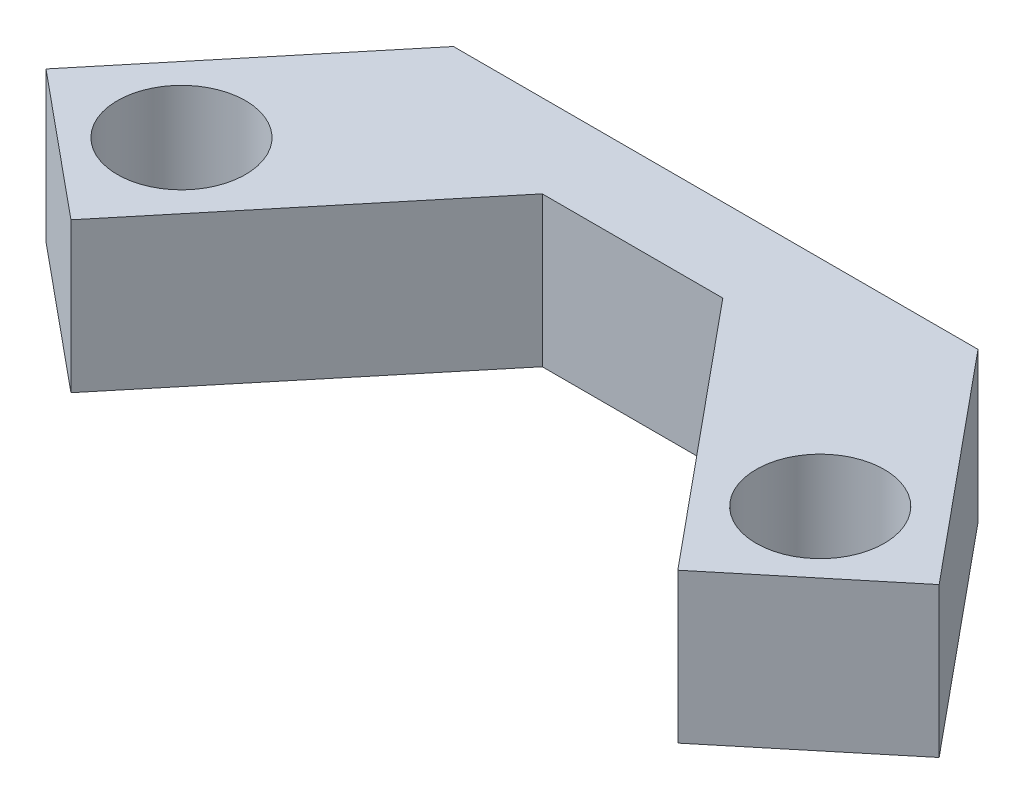
ISO-10303-21;
HEADER;
FILE_DESCRIPTION(('STEP AP214'),'2;1');
FILE_NAME('part.step','',(''),(''),'','','');
FILE_SCHEMA(('AUTOMOTIVE_DESIGN { 1 0 10303 214 1 1 1 1 }'));
ENDSEC;
DATA;
#1=APPLICATION_CONTEXT('core data for automotive mechanical design processes');
#2=APPLICATION_PROTOCOL_DEFINITION('international standard','automotive_design',2000,#1);
#3=PRODUCT_CONTEXT('',#1,'mechanical');
#4=PRODUCT('Part','Part','',(#3));
#5=PRODUCT_RELATED_PRODUCT_CATEGORY('part','',(#4));
#6=PRODUCT_DEFINITION_FORMATION('','',#4);
#7=PRODUCT_DEFINITION_CONTEXT('part definition',#1,'design');
#8=PRODUCT_DEFINITION('design','',#6,#7);
#9=PRODUCT_DEFINITION_SHAPE('','',#8);
#10=(LENGTH_UNIT() NAMED_UNIT(*) SI_UNIT(.MILLI.,.METRE.));
#11=(NAMED_UNIT(*) PLANE_ANGLE_UNIT() SI_UNIT($,.RADIAN.));
#12=(NAMED_UNIT(*) SI_UNIT($,.STERADIAN.) SOLID_ANGLE_UNIT());
#13=UNCERTAINTY_MEASURE_WITH_UNIT(LENGTH_MEASURE(1.E-05),#10,'distance_accuracy_value','');
#14=(GEOMETRIC_REPRESENTATION_CONTEXT(3) GLOBAL_UNCERTAINTY_ASSIGNED_CONTEXT((#13)) GLOBAL_UNIT_ASSIGNED_CONTEXT((#10,
#11,#12)) REPRESENTATION_CONTEXT('',''));
#15=CARTESIAN_POINT('',(0.,0.,0.));
#16=DIRECTION('',(0.,0.,1.));
#17=DIRECTION('',(1.,0.,0.));
#18=AXIS2_PLACEMENT_3D('',#15,#16,#17);
#19=CARTESIAN_POINT('',(0.,18.,0.));
#20=DIRECTION('',(0.,-1.,0.));
#21=DIRECTION('',(0.,0.,-1.));
#22=AXIS2_PLACEMENT_3D('',#19,#20,#21);
#23=PLANE('',#22);
#24=DIRECTION('',(-0.636770140264585,0.,-0.771053687149877));
#25=VECTOR('',#24,1.);
#26=CARTESIAN_POINT('',(29.8117385024772,18.,-15.2291264643002));
#27=LINE('',#26,#25);
#28=CARTESIAN_POINT('',(51.9636815392231,18.,11.5942691002592));
#29=VERTEX_POINT('',#28);
#30=CARTESIAN_POINT('',(29.8117385024772,18.,-15.2291264643002));
#31=VERTEX_POINT('',#30);
#32=EDGE_CURVE('E166',#29,#31,#27,.T.);
#33=ORIENTED_EDGE('',*,*,#32,.T.);
#34=DIRECTION('',(-1.,0.,0.));
#35=VECTOR('',#34,1.);
#36=CARTESIAN_POINT('',(-33.2382614975228,18.,-15.2291264643002));
#37=LINE('',#36,#35);
#38=CARTESIAN_POINT('',(-33.2382614975228,18.,-15.2291264643002));
#39=VERTEX_POINT('',#38);
#40=EDGE_CURVE('E102',#31,#39,#37,.T.);
#41=ORIENTED_EDGE('',*,*,#40,.T.);
#42=DIRECTION('',(-0.636770140264585,0.,0.771053687149877));
#43=VECTOR('',#42,1.);
#44=CARTESIAN_POINT('',(-33.2382614975228,18.,-15.2291264643002));
#45=LINE('',#44,#43);
#46=CARTESIAN_POINT('',(-55.3902045342687,18.,11.5942691002592));
#47=VERTEX_POINT('',#46);
#48=EDGE_CURVE('E187',#39,#47,#45,.T.);
#49=ORIENTED_EDGE('',*,*,#48,.T.);
#50=DIRECTION('',(0.771053687149877,0.,0.636770140264585));
#51=VECTOR('',#50,1.);
#52=CARTESIAN_POINT('',(-55.3902045342687,18.,11.5942691002592));
#53=LINE('',#52,#51);
#54=CARTESIAN_POINT('',(-38.1884914063332,18.,25.8002024403296));
#55=VERTEX_POINT('',#54);
#56=EDGE_CURVE('E201',#47,#55,#53,.T.);
#57=ORIENTED_EDGE('',*,*,#56,.T.);
#58=DIRECTION('',(0.636770140264584,0.,-0.771053687149878));
#59=VECTOR('',#58,1.);
#60=CARTESIAN_POINT('',(-38.1884914063332,18.,25.8002024403296));
#61=LINE('',#60,#59);
#62=CARTESIAN_POINT('',(-12.5631031250677,18.,-5.22912646430025));
#63=VERTEX_POINT('',#62);
#64=EDGE_CURVE('E121',#55,#63,#61,.T.);
#65=ORIENTED_EDGE('',*,*,#64,.T.);
#66=DIRECTION('',(1.,0.,0.));
#67=VECTOR('',#66,1.);
#68=CARTESIAN_POINT('',(9.13658013002208,18.,-5.22912646430025));
#69=LINE('',#68,#67);
#70=CARTESIAN_POINT('',(9.13658013002208,18.,-5.22912646430025));
#71=VERTEX_POINT('',#70);
#72=EDGE_CURVE('E115',#63,#71,#69,.T.);
#73=ORIENTED_EDGE('',*,*,#72,.T.);
#74=DIRECTION('',(0.636770140264585,0.,0.771053687149877));
#75=VECTOR('',#74,1.);
#76=CARTESIAN_POINT('',(34.7619684112876,18.,25.8002024403295));
#77=LINE('',#76,#75);
#78=CARTESIAN_POINT('',(34.7619684112876,18.,25.8002024403295));
#79=VERTEX_POINT('',#78);
#80=EDGE_CURVE('E119',#71,#79,#77,.T.);
#81=ORIENTED_EDGE('',*,*,#80,.T.);
#82=DIRECTION('',(0.771053687149877,0.,-0.636770140264586));
#83=VECTOR('',#82,1.);
#84=CARTESIAN_POINT('',(51.9636815392231,18.,11.5942691002592));
#85=LINE('',#84,#83);
#86=EDGE_CURVE('E59',#79,#29,#85,.T.);
#87=ORIENTED_EDGE('',*,*,#86,.T.);
#88=EDGE_LOOP('',(#33,#41,#49,#57,#65,#73,#81,#87));
#89=FACE_BOUND('',#88,.T.);
#90=CARTESIAN_POINT('',(36.6767385024772,18.,10.6011720552206));
#91=DIRECTION('',(0.,1.,0.));
#92=DIRECTION('',(0.,0.,1.));
#93=AXIS2_PLACEMENT_3D('',#90,#91,#92);
#94=CIRCLE('',#93,7.7);
#95=CARTESIAN_POINT('',(36.6767385024772,18.,18.3011720552206));
#96=VERTEX_POINT('',#95);
#97=EDGE_CURVE('E148',#96,#96,#94,.T.);
#98=ORIENTED_EDGE('',*,*,#97,.F.);
#99=EDGE_LOOP('',(#98));
#100=FACE_BOUND('',#99,.T.);
#101=CARTESIAN_POINT('',(-40.1032614975228,18.,10.6011720552206));
#102=DIRECTION('',(0.,1.,0.));
#103=DIRECTION('',(0.,0.,-1.));
#104=AXIS2_PLACEMENT_3D('',#101,#102,#103);
#105=CIRCLE('',#104,7.7);
#106=CARTESIAN_POINT('',(-40.1032614975228,18.,2.90117205522064));
#107=VERTEX_POINT('',#106);
#108=EDGE_CURVE('E215',#107,#107,#105,.T.);
#109=ORIENTED_EDGE('',*,*,#108,.F.);
#110=EDGE_LOOP('',(#109));
#111=FACE_BOUND('',#110,.T.);
#112=ADVANCED_FACE('F41',(#89,#100,#111),#23,.F.);
#113=CARTESIAN_POINT('',(0.,0.,0.));
#114=DIRECTION('',(0.,-1.,0.));
#115=DIRECTION('',(0.,0.,-1.));
#116=AXIS2_PLACEMENT_3D('',#113,#114,#115);
#117=PLANE('',#116);
#118=CARTESIAN_POINT('',(36.6767385024772,0.,10.6011720552206));
#119=DIRECTION('',(0.,1.,0.));
#120=DIRECTION('',(0.,0.,1.));
#121=AXIS2_PLACEMENT_3D('',#118,#119,#120);
#122=CIRCLE('',#121,7.7);
#123=CARTESIAN_POINT('',(36.6767385024772,0.,18.3011720552206));
#124=VERTEX_POINT('',#123);
#125=EDGE_CURVE('E211',#124,#124,#122,.T.);
#126=ORIENTED_EDGE('',*,*,#125,.T.);
#127=EDGE_LOOP('',(#126));
#128=FACE_BOUND('',#127,.T.);
#129=DIRECTION('',(-0.636770140264585,0.,-0.771053687149877));
#130=VECTOR('',#129,1.);
#131=CARTESIAN_POINT('',(29.8117385024772,0.,-15.2291264643002));
#132=LINE('',#131,#130);
#133=CARTESIAN_POINT('',(51.9636815392231,0.,11.5942691002592));
#134=VERTEX_POINT('',#133);
#135=CARTESIAN_POINT('',(29.8117385024772,0.,-15.2291264643002));
#136=VERTEX_POINT('',#135);
#137=EDGE_CURVE('E143',#134,#136,#132,.T.);
#138=ORIENTED_EDGE('',*,*,#137,.F.);
#139=DIRECTION('',(0.771053687149877,0.,-0.636770140264586));
#140=VECTOR('',#139,1.);
#141=CARTESIAN_POINT('',(51.9636815392231,0.,11.5942691002592));
#142=LINE('',#141,#140);
#143=CARTESIAN_POINT('',(34.7619684112876,0.,25.8002024403295));
#144=VERTEX_POINT('',#143);
#145=EDGE_CURVE('E94',#144,#134,#142,.T.);
#146=ORIENTED_EDGE('',*,*,#145,.F.);
#147=DIRECTION('',(0.636770140264585,0.,0.771053687149877));
#148=VECTOR('',#147,1.);
#149=CARTESIAN_POINT('',(34.7619684112876,0.,25.8002024403295));
#150=LINE('',#149,#148);
#151=CARTESIAN_POINT('',(9.13658013002208,0.,-5.22912646430025));
#152=VERTEX_POINT('',#151);
#153=EDGE_CURVE('E88',#152,#144,#150,.T.);
#154=ORIENTED_EDGE('',*,*,#153,.F.);
#155=DIRECTION('',(1.,0.,0.));
#156=VECTOR('',#155,1.);
#157=CARTESIAN_POINT('',(9.13658013002208,0.,-5.22912646430025));
#158=LINE('',#157,#156);
#159=CARTESIAN_POINT('',(-12.5631031250677,0.,-5.22912646430025));
#160=VERTEX_POINT('',#159);
#161=EDGE_CURVE('E130',#160,#152,#158,.T.);
#162=ORIENTED_EDGE('',*,*,#161,.F.);
#163=DIRECTION('',(0.636770140264584,0.,-0.771053687149878));
#164=VECTOR('',#163,1.);
#165=CARTESIAN_POINT('',(-38.1884914063332,0.,25.8002024403296));
#166=LINE('',#165,#164);
#167=CARTESIAN_POINT('',(-38.1884914063332,0.,25.8002024403296));
#168=VERTEX_POINT('',#167);
#169=EDGE_CURVE('E157',#168,#160,#166,.T.);
#170=ORIENTED_EDGE('',*,*,#169,.F.);
#171=DIRECTION('',(0.771053687149877,0.,0.636770140264585));
#172=VECTOR('',#171,1.);
#173=CARTESIAN_POINT('',(-55.3902045342687,0.,11.5942691002592));
#174=LINE('',#173,#172);
#175=CARTESIAN_POINT('',(-55.3902045342687,0.,11.5942691002592));
#176=VERTEX_POINT('',#175);
#177=EDGE_CURVE('E154',#176,#168,#174,.T.);
#178=ORIENTED_EDGE('',*,*,#177,.F.);
#179=DIRECTION('',(-0.636770140264585,0.,0.771053687149877));
#180=VECTOR('',#179,1.);
#181=CARTESIAN_POINT('',(-33.2382614975228,0.,-15.2291264643002));
#182=LINE('',#181,#180);
#183=CARTESIAN_POINT('',(-33.2382614975228,0.,-15.2291264643002));
#184=VERTEX_POINT('',#183);
#185=EDGE_CURVE('E151',#184,#176,#182,.T.);
#186=ORIENTED_EDGE('',*,*,#185,.F.);
#187=DIRECTION('',(-1.,0.,0.));
#188=VECTOR('',#187,1.);
#189=CARTESIAN_POINT('',(-33.2382614975228,0.,-15.2291264643002));
#190=LINE('',#189,#188);
#191=EDGE_CURVE('E147',#136,#184,#190,.T.);
#192=ORIENTED_EDGE('',*,*,#191,.F.);
#193=EDGE_LOOP('',(#138,#146,#154,#162,#170,#178,#186,#192));
#194=FACE_BOUND('',#193,.T.);
#195=CARTESIAN_POINT('',(-40.1032614975228,0.,10.6011720552206));
#196=DIRECTION('',(0.,1.,0.));
#197=DIRECTION('',(0.,0.,-1.));
#198=AXIS2_PLACEMENT_3D('',#195,#196,#197);
#199=CIRCLE('',#198,7.7);
#200=CARTESIAN_POINT('',(-40.1032614975228,0.,2.90117205522064));
#201=VERTEX_POINT('',#200);
#202=EDGE_CURVE('E219',#201,#201,#199,.T.);
#203=ORIENTED_EDGE('',*,*,#202,.T.);
#204=EDGE_LOOP('',(#203));
#205=FACE_BOUND('',#204,.T.);
#206=ADVANCED_FACE('F191',(#128,#194,#205),#117,.T.);
#207=CARTESIAN_POINT('',(29.8117385024772,18.,-15.2291264643002));
#208=DIRECTION('',(-0.771053687149877,0.,0.636770140264585));
#209=DIRECTION('',(0.636770140264586,0.,0.771053687149877));
#210=AXIS2_PLACEMENT_3D('',#207,#208,#209);
#211=PLANE('',#210);
#212=ORIENTED_EDGE('',*,*,#137,.T.);
#213=DIRECTION('',(0.,-1.,0.));
#214=VECTOR('',#213,1.);
#215=CARTESIAN_POINT('',(29.8117385024772,18.,-15.2291264643002));
#216=LINE('',#215,#214);
#217=EDGE_CURVE('E11',#31,#136,#216,.T.);
#218=ORIENTED_EDGE('',*,*,#217,.F.);
#219=ORIENTED_EDGE('',*,*,#32,.F.);
#220=DIRECTION('',(0.,-1.,0.));
#221=VECTOR('',#220,1.);
#222=CARTESIAN_POINT('',(51.9636815392231,18.,11.5942691002592));
#223=LINE('',#222,#221);
#224=EDGE_CURVE('E139',#29,#134,#223,.T.);
#225=ORIENTED_EDGE('',*,*,#224,.T.);
#226=EDGE_LOOP('',(#212,#218,#219,#225));
#227=FACE_BOUND('',#226,.T.);
#228=ADVANCED_FACE('F43',(#227),#211,.F.);
#229=CARTESIAN_POINT('',(-33.2382614975228,18.,-15.2291264643002));
#230=DIRECTION('',(0.,0.,1.));
#231=DIRECTION('',(1.,0.,0.));
#232=AXIS2_PLACEMENT_3D('',#229,#230,#231);
#233=PLANE('',#232);
#234=ORIENTED_EDGE('',*,*,#191,.T.);
#235=DIRECTION('',(0.,-1.,0.));
#236=VECTOR('',#235,1.);
#237=CARTESIAN_POINT('',(-33.2382614975228,18.,-15.2291264643002));
#238=LINE('',#237,#236);
#239=EDGE_CURVE('E51',#39,#184,#238,.T.);
#240=ORIENTED_EDGE('',*,*,#239,.F.);
#241=ORIENTED_EDGE('',*,*,#40,.F.);
#242=ORIENTED_EDGE('',*,*,#217,.T.);
#243=EDGE_LOOP('',(#234,#240,#241,#242));
#244=FACE_BOUND('',#243,.T.);
#245=ADVANCED_FACE('F253',(#244),#233,.F.);
#246=CARTESIAN_POINT('',(-33.2382614975228,18.,-15.2291264643002));
#247=DIRECTION('',(0.771053687149877,0.,0.636770140264585));
#248=DIRECTION('',(0.636770140264585,0.,-0.771053687149877));
#249=AXIS2_PLACEMENT_3D('',#246,#247,#248);
#250=PLANE('',#249);
#251=ORIENTED_EDGE('',*,*,#185,.T.);
#252=DIRECTION('',(0.,-1.,0.));
#253=VECTOR('',#252,1.);
#254=CARTESIAN_POINT('',(-55.3902045342687,18.,11.5942691002592));
#255=LINE('',#254,#253);
#256=EDGE_CURVE('E177',#47,#176,#255,.T.);
#257=ORIENTED_EDGE('',*,*,#256,.F.);
#258=ORIENTED_EDGE('',*,*,#48,.F.);
#259=ORIENTED_EDGE('',*,*,#239,.T.);
#260=EDGE_LOOP('',(#251,#257,#258,#259));
#261=FACE_BOUND('',#260,.T.);
#262=ADVANCED_FACE('F185',(#261),#250,.F.);
#263=CARTESIAN_POINT('',(-55.3902045342687,18.,11.5942691002592));
#264=DIRECTION('',(0.636770140264585,0.,-0.771053687149877));
#265=DIRECTION('',(-0.771053687149877,0.,-0.636770140264585));
#266=AXIS2_PLACEMENT_3D('',#263,#264,#265);
#267=PLANE('',#266);
#268=ORIENTED_EDGE('',*,*,#177,.T.);
#269=DIRECTION('',(0.,-1.,0.));
#270=VECTOR('',#269,1.);
#271=CARTESIAN_POINT('',(-38.1884914063332,18.,25.8002024403296));
#272=LINE('',#271,#270);
#273=EDGE_CURVE('E173',#55,#168,#272,.T.);
#274=ORIENTED_EDGE('',*,*,#273,.F.);
#275=ORIENTED_EDGE('',*,*,#56,.F.);
#276=ORIENTED_EDGE('',*,*,#256,.T.);
#277=EDGE_LOOP('',(#268,#274,#275,#276));
#278=FACE_BOUND('',#277,.T.);
#279=ADVANCED_FACE('F196',(#278),#267,.F.);
#280=CARTESIAN_POINT('',(-38.1884914063332,18.,25.8002024403296));
#281=DIRECTION('',(-0.771053687149878,0.,-0.636770140264584));
#282=DIRECTION('',(-0.636770140264584,0.,0.771053687149878));
#283=AXIS2_PLACEMENT_3D('',#280,#281,#282);
#284=PLANE('',#283);
#285=ORIENTED_EDGE('',*,*,#169,.T.);
#286=DIRECTION('',(0.,-1.,0.));
#287=VECTOR('',#286,1.);
#288=CARTESIAN_POINT('',(-12.5631031250677,18.,-5.22912646430025));
#289=LINE('',#288,#287);
#290=EDGE_CURVE('E132',#63,#160,#289,.T.);
#291=ORIENTED_EDGE('',*,*,#290,.F.);
#292=ORIENTED_EDGE('',*,*,#64,.F.);
#293=ORIENTED_EDGE('',*,*,#273,.T.);
#294=EDGE_LOOP('',(#285,#291,#292,#293));
#295=FACE_BOUND('',#294,.T.);
#296=ADVANCED_FACE('F199',(#295),#284,.F.);
#297=CARTESIAN_POINT('',(9.13658013002208,18.,-5.22912646430025));
#298=DIRECTION('',(0.,0.,-1.));
#299=DIRECTION('',(-1.,0.,0.));
#300=AXIS2_PLACEMENT_3D('',#297,#298,#299);
#301=PLANE('',#300);
#302=ORIENTED_EDGE('',*,*,#161,.T.);
#303=DIRECTION('',(0.,-1.,0.));
#304=VECTOR('',#303,1.);
#305=CARTESIAN_POINT('',(9.13658013002208,18.,-5.22912646430025));
#306=LINE('',#305,#304);
#307=EDGE_CURVE('E127',#71,#152,#306,.T.);
#308=ORIENTED_EDGE('',*,*,#307,.F.);
#309=ORIENTED_EDGE('',*,*,#72,.F.);
#310=ORIENTED_EDGE('',*,*,#290,.T.);
#311=EDGE_LOOP('',(#302,#308,#309,#310));
#312=FACE_BOUND('',#311,.T.);
#313=ADVANCED_FACE('F128',(#312),#301,.F.);
#314=CARTESIAN_POINT('',(34.7619684112876,18.,25.8002024403295));
#315=DIRECTION('',(0.771053687149877,0.,-0.636770140264585));
#316=DIRECTION('',(-0.636770140264585,0.,-0.771053687149878));
#317=AXIS2_PLACEMENT_3D('',#314,#315,#316);
#318=PLANE('',#317);
#319=ORIENTED_EDGE('',*,*,#153,.T.);
#320=DIRECTION('',(0.,-1.,0.));
#321=VECTOR('',#320,1.);
#322=CARTESIAN_POINT('',(34.7619684112876,18.,25.8002024403295));
#323=LINE('',#322,#321);
#324=EDGE_CURVE('E133',#79,#144,#323,.T.);
#325=ORIENTED_EDGE('',*,*,#324,.F.);
#326=ORIENTED_EDGE('',*,*,#80,.F.);
#327=ORIENTED_EDGE('',*,*,#307,.T.);
#328=EDGE_LOOP('',(#319,#325,#326,#327));
#329=FACE_BOUND('',#328,.T.);
#330=ADVANCED_FACE('F135',(#329),#318,.F.);
#331=CARTESIAN_POINT('',(51.9636815392231,18.,11.5942691002592));
#332=DIRECTION('',(-0.636770140264585,0.,-0.771053687149877));
#333=DIRECTION('',(-0.771053687149877,0.,0.636770140264585));
#334=AXIS2_PLACEMENT_3D('',#331,#332,#333);
#335=PLANE('',#334);
#336=ORIENTED_EDGE('',*,*,#145,.T.);
#337=ORIENTED_EDGE('',*,*,#224,.F.);
#338=ORIENTED_EDGE('',*,*,#86,.F.);
#339=ORIENTED_EDGE('',*,*,#324,.T.);
#340=EDGE_LOOP('',(#336,#337,#338,#339));
#341=FACE_BOUND('',#340,.T.);
#342=ADVANCED_FACE('F241',(#341),#335,.F.);
#343=CARTESIAN_POINT('',(36.6767385024772,18.,10.6011720552206));
#344=DIRECTION('',(0.,-1.,0.));
#345=DIRECTION('',(0.,0.,-1.));
#346=AXIS2_PLACEMENT_3D('',#343,#344,#345);
#347=CYLINDRICAL_SURFACE('',#346,7.7);
#348=ORIENTED_EDGE('',*,*,#97,.T.);
#349=EDGE_LOOP('',(#348));
#350=FACE_BOUND('',#349,.T.);
#351=ORIENTED_EDGE('',*,*,#125,.F.);
#352=EDGE_LOOP('',(#351));
#353=FACE_BOUND('',#352,.T.);
#354=ADVANCED_FACE('F238',(#350,#353),#347,.F.);
#355=CARTESIAN_POINT('',(-40.1032614975228,18.,10.6011720552206));
#356=DIRECTION('',(0.,-1.,0.));
#357=DIRECTION('',(0.,0.,-1.));
#358=AXIS2_PLACEMENT_3D('',#355,#356,#357);
#359=CYLINDRICAL_SURFACE('',#358,7.7);
#360=ORIENTED_EDGE('',*,*,#108,.T.);
#361=EDGE_LOOP('',(#360));
#362=FACE_BOUND('',#361,.T.);
#363=ORIENTED_EDGE('',*,*,#202,.F.);
#364=EDGE_LOOP('',(#363));
#365=FACE_BOUND('',#364,.T.);
#366=ADVANCED_FACE('F227',(#362,#365),#359,.F.);
#367=CLOSED_SHELL('',(#112,#206,#228,#245,#262,#279,#296,#313,#330,#342,#354,#366));
#368=MANIFOLD_SOLID_BREP('B2',#367);
#369=ADVANCED_BREP_SHAPE_REPRESENTATION('',(#18,#368),#14);
#370=SHAPE_DEFINITION_REPRESENTATION(#9,#369);
ENDSEC;
END-ISO-10303-21;
